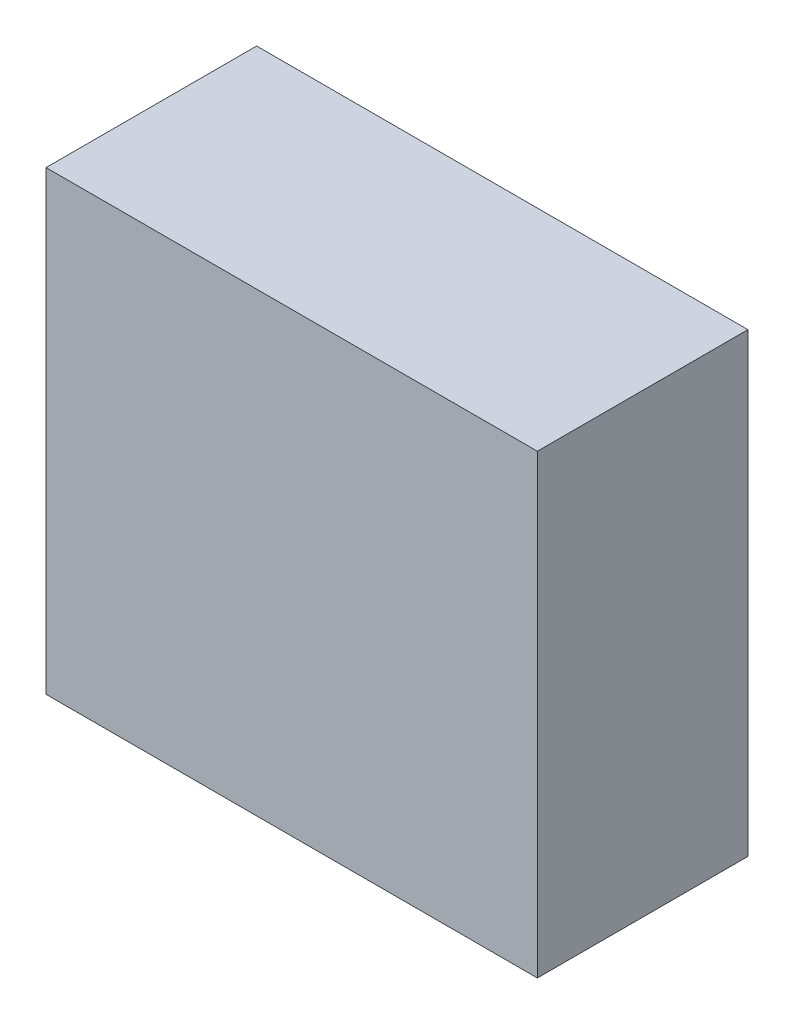
ISO-10303-21;
HEADER;
FILE_DESCRIPTION(('STEP AP214'),'2;1');
FILE_NAME('part.step','',(''),(''),'','','');
FILE_SCHEMA(('AUTOMOTIVE_DESIGN { 1 0 10303 214 1 1 1 1 }'));
ENDSEC;
DATA;
#1=APPLICATION_CONTEXT('core data for automotive mechanical design processes');
#2=APPLICATION_PROTOCOL_DEFINITION('international standard','automotive_design',2000,#1);
#3=PRODUCT_CONTEXT('',#1,'mechanical');
#4=PRODUCT('Part','Part','',(#3));
#5=PRODUCT_RELATED_PRODUCT_CATEGORY('part','',(#4));
#6=PRODUCT_DEFINITION_FORMATION('','',#4);
#7=PRODUCT_DEFINITION_CONTEXT('part definition',#1,'design');
#8=PRODUCT_DEFINITION('design','',#6,#7);
#9=PRODUCT_DEFINITION_SHAPE('','',#8);
#10=(LENGTH_UNIT() NAMED_UNIT(*) SI_UNIT(.MILLI.,.METRE.));
#11=(NAMED_UNIT(*) PLANE_ANGLE_UNIT() SI_UNIT($,.RADIAN.));
#12=(NAMED_UNIT(*) SI_UNIT($,.STERADIAN.) SOLID_ANGLE_UNIT());
#13=UNCERTAINTY_MEASURE_WITH_UNIT(LENGTH_MEASURE(1.E-05),#10,'distance_accuracy_value','');
#14=(GEOMETRIC_REPRESENTATION_CONTEXT(3) GLOBAL_UNCERTAINTY_ASSIGNED_CONTEXT((#13)) GLOBAL_UNIT_ASSIGNED_CONTEXT((#10,
#11,#12)) REPRESENTATION_CONTEXT('',''));
#15=CARTESIAN_POINT('',(0.,0.,0.));
#16=DIRECTION('',(0.,0.,1.));
#17=DIRECTION('',(1.,0.,0.));
#18=AXIS2_PLACEMENT_3D('',#15,#16,#17);
#19=CARTESIAN_POINT('',(0.,165.1,0.));
#20=DIRECTION('',(1.,0.,0.));
#21=DIRECTION('',(0.,0.,-1.));
#22=AXIS2_PLACEMENT_3D('',#19,#20,#21);
#23=PLANE('',#22);
#24=DIRECTION('',(0.,0.,1.));
#25=VECTOR('',#24,1.);
#26=CARTESIAN_POINT('',(0.,0.,0.));
#27=LINE('',#26,#25);
#28=CARTESIAN_POINT('',(0.,0.,-76.2));
#29=VERTEX_POINT('',#28);
#30=CARTESIAN_POINT('',(0.,0.,0.));
#31=VERTEX_POINT('',#30);
#32=EDGE_CURVE('E110',#29,#31,#27,.T.);
#33=ORIENTED_EDGE('',*,*,#32,.T.);
#34=DIRECTION('',(0.,-1.,0.));
#35=VECTOR('',#34,1.);
#36=CARTESIAN_POINT('',(0.,165.1,0.));
#37=LINE('',#36,#35);
#38=CARTESIAN_POINT('',(0.,165.1,0.));
#39=VERTEX_POINT('',#38);
#40=EDGE_CURVE('E11',#39,#31,#37,.T.);
#41=ORIENTED_EDGE('',*,*,#40,.F.);
#42=DIRECTION('',(0.,0.,1.));
#43=VECTOR('',#42,1.);
#44=CARTESIAN_POINT('',(0.,165.1,0.));
#45=LINE('',#44,#43);
#46=CARTESIAN_POINT('',(0.,165.1,-76.2));
#47=VERTEX_POINT('',#46);
#48=EDGE_CURVE('E94',#47,#39,#45,.T.);
#49=ORIENTED_EDGE('',*,*,#48,.F.);
#50=DIRECTION('',(0.,-1.,0.));
#51=VECTOR('',#50,1.);
#52=CARTESIAN_POINT('',(0.,165.1,-76.2));
#53=LINE('',#52,#51);
#54=EDGE_CURVE('E106',#47,#29,#53,.T.);
#55=ORIENTED_EDGE('',*,*,#54,.T.);
#56=EDGE_LOOP('',(#33,#41,#49,#55));
#57=FACE_BOUND('',#56,.T.);
#58=ADVANCED_FACE('F42',(#57),#23,.F.);
#59=CARTESIAN_POINT('',(0.,165.1,0.));
#60=DIRECTION('',(0.,0.,-1.));
#61=DIRECTION('',(-1.,0.,0.));
#62=AXIS2_PLACEMENT_3D('',#59,#60,#61);
#63=PLANE('',#62);
#64=DIRECTION('',(1.,0.,0.));
#65=VECTOR('',#64,1.);
#66=CARTESIAN_POINT('',(0.,0.,0.));
#67=LINE('',#66,#65);
#68=CARTESIAN_POINT('',(177.8,0.,0.));
#69=VERTEX_POINT('',#68);
#70=EDGE_CURVE('E99',#31,#69,#67,.T.);
#71=ORIENTED_EDGE('',*,*,#70,.T.);
#72=DIRECTION('',(0.,-1.,0.));
#73=VECTOR('',#72,1.);
#74=CARTESIAN_POINT('',(177.8,165.1,0.));
#75=LINE('',#74,#73);
#76=CARTESIAN_POINT('',(177.8,165.1,0.));
#77=VERTEX_POINT('',#76);
#78=EDGE_CURVE('E51',#77,#69,#75,.T.);
#79=ORIENTED_EDGE('',*,*,#78,.F.);
#80=DIRECTION('',(1.,0.,0.));
#81=VECTOR('',#80,1.);
#82=CARTESIAN_POINT('',(0.,165.1,0.));
#83=LINE('',#82,#81);
#84=EDGE_CURVE('E89',#39,#77,#83,.T.);
#85=ORIENTED_EDGE('',*,*,#84,.F.);
#86=ORIENTED_EDGE('',*,*,#40,.T.);
#87=EDGE_LOOP('',(#71,#79,#85,#86));
#88=FACE_BOUND('',#87,.T.);
#89=ADVANCED_FACE('F98',(#88),#63,.F.);
#90=CARTESIAN_POINT('',(177.8,165.1,0.));
#91=DIRECTION('',(-1.,0.,0.));
#92=DIRECTION('',(0.,0.,1.));
#93=AXIS2_PLACEMENT_3D('',#90,#91,#92);
#94=PLANE('',#93);
#95=DIRECTION('',(0.,0.,-1.));
#96=VECTOR('',#95,1.);
#97=CARTESIAN_POINT('',(177.8,0.,0.));
#98=LINE('',#97,#96);
#99=CARTESIAN_POINT('',(177.8,0.,-76.2));
#100=VERTEX_POINT('',#99);
#101=EDGE_CURVE('E76',#69,#100,#98,.T.);
#102=ORIENTED_EDGE('',*,*,#101,.T.);
#103=DIRECTION('',(0.,-1.,0.));
#104=VECTOR('',#103,1.);
#105=CARTESIAN_POINT('',(177.8,165.1,-76.2));
#106=LINE('',#105,#104);
#107=CARTESIAN_POINT('',(177.8,165.1,-76.2));
#108=VERTEX_POINT('',#107);
#109=EDGE_CURVE('E101',#108,#100,#106,.T.);
#110=ORIENTED_EDGE('',*,*,#109,.F.);
#111=DIRECTION('',(0.,0.,-1.));
#112=VECTOR('',#111,1.);
#113=CARTESIAN_POINT('',(177.8,165.1,0.));
#114=LINE('',#113,#112);
#115=EDGE_CURVE('E92',#77,#108,#114,.T.);
#116=ORIENTED_EDGE('',*,*,#115,.F.);
#117=ORIENTED_EDGE('',*,*,#78,.T.);
#118=EDGE_LOOP('',(#102,#110,#116,#117));
#119=FACE_BOUND('',#118,.T.);
#120=ADVANCED_FACE('F102',(#119),#94,.F.);
#121=CARTESIAN_POINT('',(0.,165.1,-76.2));
#122=DIRECTION('',(0.,0.,1.));
#123=DIRECTION('',(1.,0.,0.));
#124=AXIS2_PLACEMENT_3D('',#121,#122,#123);
#125=PLANE('',#124);
#126=DIRECTION('',(-1.,0.,0.));
#127=VECTOR('',#126,1.);
#128=CARTESIAN_POINT('',(0.,0.,-76.2));
#129=LINE('',#128,#127);
#130=EDGE_CURVE('E82',#100,#29,#129,.T.);
#131=ORIENTED_EDGE('',*,*,#130,.T.);
#132=ORIENTED_EDGE('',*,*,#54,.F.);
#133=DIRECTION('',(-1.,0.,0.));
#134=VECTOR('',#133,1.);
#135=CARTESIAN_POINT('',(0.,165.1,-76.2));
#136=LINE('',#135,#134);
#137=EDGE_CURVE('E59',#108,#47,#136,.T.);
#138=ORIENTED_EDGE('',*,*,#137,.F.);
#139=ORIENTED_EDGE('',*,*,#109,.T.);
#140=EDGE_LOOP('',(#131,#132,#138,#139));
#141=FACE_BOUND('',#140,.T.);
#142=ADVANCED_FACE('F123',(#141),#125,.F.);
#143=CARTESIAN_POINT('',(0.,165.1,0.));
#144=DIRECTION('',(0.,-1.,0.));
#145=DIRECTION('',(0.,0.,-1.));
#146=AXIS2_PLACEMENT_3D('',#143,#144,#145);
#147=PLANE('',#146);
#148=ORIENTED_EDGE('',*,*,#48,.T.);
#149=ORIENTED_EDGE('',*,*,#84,.T.);
#150=ORIENTED_EDGE('',*,*,#115,.T.);
#151=ORIENTED_EDGE('',*,*,#137,.T.);
#152=EDGE_LOOP('',(#148,#149,#150,#151));
#153=FACE_BOUND('',#152,.T.);
#154=ADVANCED_FACE('F90',(#153),#147,.F.);
#155=CARTESIAN_POINT('',(0.,0.,0.));
#156=DIRECTION('',(0.,-1.,0.));
#157=DIRECTION('',(0.,0.,-1.));
#158=AXIS2_PLACEMENT_3D('',#155,#156,#157);
#159=PLANE('',#158);
#160=ORIENTED_EDGE('',*,*,#32,.F.);
#161=ORIENTED_EDGE('',*,*,#130,.F.);
#162=ORIENTED_EDGE('',*,*,#101,.F.);
#163=ORIENTED_EDGE('',*,*,#70,.F.);
#164=EDGE_LOOP('',(#160,#161,#162,#163));
#165=FACE_BOUND('',#164,.T.);
#166=ADVANCED_FACE('F126',(#165),#159,.T.);
#167=CLOSED_SHELL('',(#58,#89,#120,#142,#154,#166));
#168=MANIFOLD_SOLID_BREP('B2',#167);
#169=ADVANCED_BREP_SHAPE_REPRESENTATION('',(#18,#168),#14);
#170=SHAPE_DEFINITION_REPRESENTATION(#9,#169);
ENDSEC;
END-ISO-10303-21;
